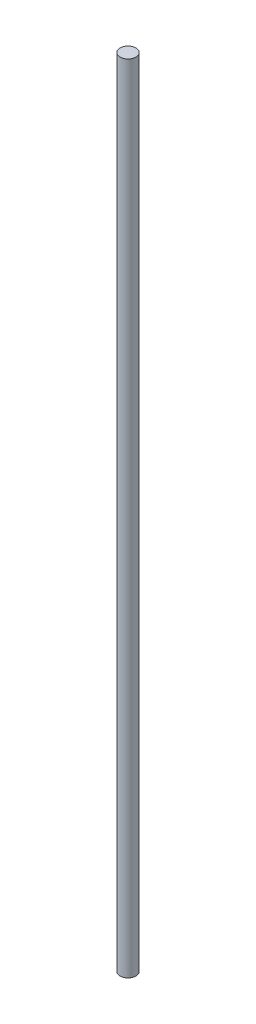
ISO-10303-21;
HEADER;
FILE_DESCRIPTION(('STEP AP214'),'2;1');
FILE_NAME('part.step','',(''),(''),'','','');
FILE_SCHEMA(('AUTOMOTIVE_DESIGN { 1 0 10303 214 1 1 1 1 }'));
ENDSEC;
DATA;
#1=APPLICATION_CONTEXT('core data for automotive mechanical design processes');
#2=APPLICATION_PROTOCOL_DEFINITION('international standard','automotive_design',2000,#1);
#3=PRODUCT_CONTEXT('',#1,'mechanical');
#4=PRODUCT('Part','Part','',(#3));
#5=PRODUCT_RELATED_PRODUCT_CATEGORY('part','',(#4));
#6=PRODUCT_DEFINITION_FORMATION('','',#4);
#7=PRODUCT_DEFINITION_CONTEXT('part definition',#1,'design');
#8=PRODUCT_DEFINITION('design','',#6,#7);
#9=PRODUCT_DEFINITION_SHAPE('','',#8);
#10=(LENGTH_UNIT() NAMED_UNIT(*) SI_UNIT(.MILLI.,.METRE.));
#11=(NAMED_UNIT(*) PLANE_ANGLE_UNIT() SI_UNIT($,.RADIAN.));
#12=(NAMED_UNIT(*) SI_UNIT($,.STERADIAN.) SOLID_ANGLE_UNIT());
#13=UNCERTAINTY_MEASURE_WITH_UNIT(LENGTH_MEASURE(1.E-05),#10,'distance_accuracy_value','');
#14=(GEOMETRIC_REPRESENTATION_CONTEXT(3) GLOBAL_UNCERTAINTY_ASSIGNED_CONTEXT((#13)) GLOBAL_UNIT_ASSIGNED_CONTEXT((#10,
#11,#12)) REPRESENTATION_CONTEXT('',''));
#15=CARTESIAN_POINT('',(0.,0.,0.));
#16=DIRECTION('',(0.,0.,1.));
#17=DIRECTION('',(1.,0.,0.));
#18=AXIS2_PLACEMENT_3D('',#15,#16,#17);
#19=CARTESIAN_POINT('',(0.,400.,0.));
#20=DIRECTION('',(0.,-1.,0.));
#21=DIRECTION('',(0.,0.,-1.));
#22=AXIS2_PLACEMENT_3D('',#19,#20,#21);
#23=CYLINDRICAL_SURFACE('',#22,4.);
#24=CARTESIAN_POINT('',(0.,400.,0.));
#25=DIRECTION('',(0.,1.,0.));
#26=DIRECTION('',(0.,0.,1.));
#27=AXIS2_PLACEMENT_3D('',#24,#25,#26);
#28=CIRCLE('',#27,4.);
#29=CARTESIAN_POINT('',(0.,400.,4.));
#30=VERTEX_POINT('',#29);
#31=EDGE_CURVE('E10',#30,#30,#28,.T.);
#32=ORIENTED_EDGE('',*,*,#31,.F.);
#33=EDGE_LOOP('',(#32));
#34=FACE_BOUND('',#33,.T.);
#35=CARTESIAN_POINT('',(0.,0.,0.));
#36=DIRECTION('',(0.,1.,0.));
#37=DIRECTION('',(0.,0.,1.));
#38=AXIS2_PLACEMENT_3D('',#35,#36,#37);
#39=CIRCLE('',#38,4.);
#40=CARTESIAN_POINT('',(0.,0.,4.));
#41=VERTEX_POINT('',#40);
#42=EDGE_CURVE('E38',#41,#41,#39,.T.);
#43=ORIENTED_EDGE('',*,*,#42,.T.);
#44=EDGE_LOOP('',(#43));
#45=FACE_BOUND('',#44,.T.);
#46=ADVANCED_FACE('F35',(#34,#45),#23,.T.);
#47=CARTESIAN_POINT('',(0.,400.,0.));
#48=DIRECTION('',(0.,1.,0.));
#49=DIRECTION('',(0.,0.,1.));
#50=AXIS2_PLACEMENT_3D('',#47,#48,#49);
#51=PLANE('',#50);
#52=ORIENTED_EDGE('',*,*,#31,.T.);
#53=EDGE_LOOP('',(#52));
#54=FACE_BOUND('',#53,.T.);
#55=ADVANCED_FACE('F50',(#54),#51,.T.);
#56=CARTESIAN_POINT('',(0.,0.,0.));
#57=DIRECTION('',(0.,1.,0.));
#58=DIRECTION('',(0.,0.,1.));
#59=AXIS2_PLACEMENT_3D('',#56,#57,#58);
#60=PLANE('',#59);
#61=ORIENTED_EDGE('',*,*,#42,.F.);
#62=EDGE_LOOP('',(#61));
#63=FACE_BOUND('',#62,.T.);
#64=ADVANCED_FACE('F48',(#63),#60,.F.);
#65=CLOSED_SHELL('',(#46,#55,#64));
#66=MANIFOLD_SOLID_BREP('B2',#65);
#67=ADVANCED_BREP_SHAPE_REPRESENTATION('',(#18,#66),#14);
#68=SHAPE_DEFINITION_REPRESENTATION(#9,#67);
ENDSEC;
END-ISO-10303-21;
